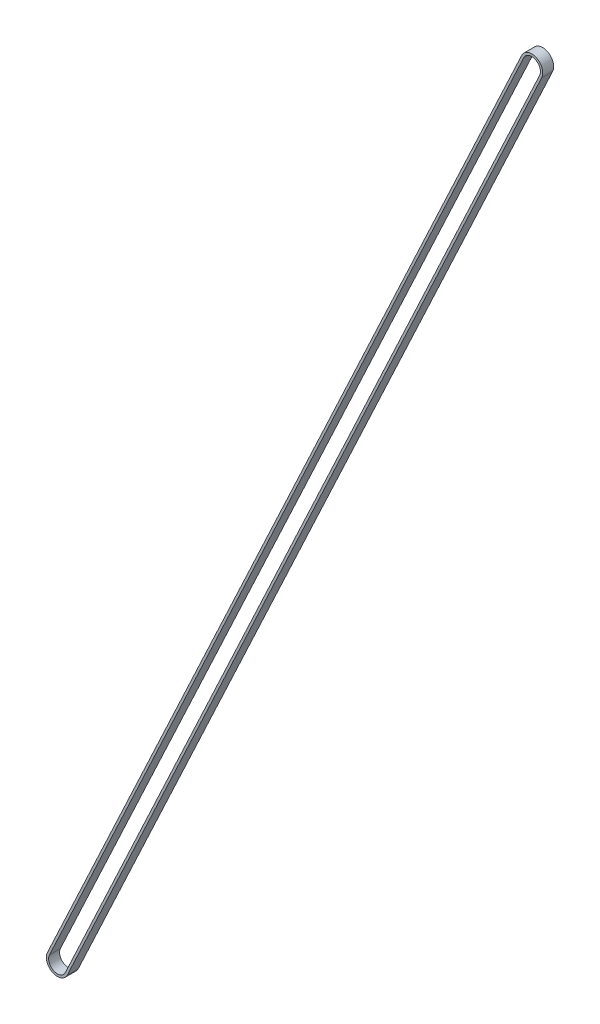
ISO-10303-21;
HEADER;
FILE_DESCRIPTION(('STEP AP214'),'2;1');
FILE_NAME('part.step','',(''),(''),'','','');
FILE_SCHEMA(('AUTOMOTIVE_DESIGN { 1 0 10303 214 1 1 1 1 }'));
ENDSEC;
DATA;
#1=APPLICATION_CONTEXT('core data for automotive mechanical design processes');
#2=APPLICATION_PROTOCOL_DEFINITION('international standard','automotive_design',2000,#1);
#3=PRODUCT_CONTEXT('',#1,'mechanical');
#4=PRODUCT('Part','Part','',(#3));
#5=PRODUCT_RELATED_PRODUCT_CATEGORY('part','',(#4));
#6=PRODUCT_DEFINITION_FORMATION('','',#4);
#7=PRODUCT_DEFINITION_CONTEXT('part definition',#1,'design');
#8=PRODUCT_DEFINITION('design','',#6,#7);
#9=PRODUCT_DEFINITION_SHAPE('','',#8);
#10=(LENGTH_UNIT() NAMED_UNIT(*) SI_UNIT(.MILLI.,.METRE.));
#11=(NAMED_UNIT(*) PLANE_ANGLE_UNIT() SI_UNIT($,.RADIAN.));
#12=(NAMED_UNIT(*) SI_UNIT($,.STERADIAN.) SOLID_ANGLE_UNIT());
#13=UNCERTAINTY_MEASURE_WITH_UNIT(LENGTH_MEASURE(1.E-05),#10,'distance_accuracy_value','');
#14=(GEOMETRIC_REPRESENTATION_CONTEXT(3) GLOBAL_UNCERTAINTY_ASSIGNED_CONTEXT((#13)) GLOBAL_UNIT_ASSIGNED_CONTEXT((#10,
#11,#12)) REPRESENTATION_CONTEXT('',''));
#15=CARTESIAN_POINT('',(0.,0.,0.));
#16=DIRECTION('',(0.,0.,1.));
#17=DIRECTION('',(1.,0.,0.));
#18=AXIS2_PLACEMENT_3D('',#15,#16,#17);
#19=CARTESIAN_POINT('',(-2.15892876727075,13.6484173672822,-7.26980860200179));
#20=DIRECTION('',(0.,0.,1.));
#21=DIRECTION('',(0.,-1.,0.));
#22=AXIS2_PLACEMENT_3D('',#19,#20,#21);
#23=PLANE('',#22);
#24=DIRECTION('',(0.423643456524163,0.905829024564934,0.));
#25=VECTOR('',#24,1.);
#26=CARTESIAN_POINT('',(16.4253102642104,8.0638701509914,-7.26980860200045));
#27=LINE('',#26,#25);
#28=CARTESIAN_POINT('',(-808.996594894675,-1756.84269854508,-7.26980860192287));
#29=VERTEX_POINT('',#28);
#30=CARTESIAN_POINT('',(15.232988504376,5.51446300201818,-7.26980860200033));
#31=VERTEX_POINT('',#30);
#32=EDGE_CURVE('E162',#29,#31,#27,.T.);
#33=ORIENTED_EDGE('',*,*,#32,.T.);
#34=CARTESIAN_POINT('',(-2.15892876727075,13.6484173672822,-7.26980860200179));
#35=DIRECTION('',(0.,0.,1.));
#36=DIRECTION('',(0.,-1.,0.));
#37=AXIS2_PLACEMENT_3D('',#34,#35,#36);
#38=CIRCLE('',#37,19.2);
#39=CARTESIAN_POINT('',(-19.5508460389174,21.7823717325461,-7.26980860200325));
#40=VERTEX_POINT('',#39);
#41=EDGE_CURVE('E165',#31,#40,#38,.T.);
#42=ORIENTED_EDGE('',*,*,#41,.T.);
#43=DIRECTION('',(-0.423643456524163,-0.905829024564934,0.));
#44=VECTOR('',#43,1.);
#45=CARTESIAN_POINT('',(-18.358524279083,24.3317788815192,-7.26980860200336));
#46=LINE('',#45,#44);
#47=CARTESIAN_POINT('',(-843.780429437968,-1740.57478981455,-7.26980860192579));
#48=VERTEX_POINT('',#47);
#49=EDGE_CURVE('E168',#40,#48,#46,.T.);
#50=ORIENTED_EDGE('',*,*,#49,.T.);
#51=CARTESIAN_POINT('',(-826.388512166321,-1748.70874417981,-7.26980860192433));
#52=DIRECTION('',(0.,0.,1.));
#53=DIRECTION('',(0.,-1.,0.));
#54=AXIS2_PLACEMENT_3D('',#51,#52,#53);
#55=CIRCLE('',#54,19.1999999999999);
#56=EDGE_CURVE('E170',#48,#29,#55,.T.);
#57=ORIENTED_EDGE('',*,*,#56,.T.);
#58=EDGE_LOOP('',(#33,#42,#50,#57));
#59=FACE_BOUND('',#58,.T.);
#60=CARTESIAN_POINT('',(-2.15892876727075,13.6484173672822,-7.26980860200179));
#61=DIRECTION('',(0.,0.,1.));
#62=DIRECTION('',(0.,-1.,0.));
#63=AXIS2_PLACEMENT_3D('',#60,#61,#62);
#64=CIRCLE('',#63,15.2);
#65=CARTESIAN_POINT('',(11.6096724061162,7.20903682811484,-7.26980860200064));
#66=VERTEX_POINT('',#65);
#67=CARTESIAN_POINT('',(-15.9275299406576,20.0877979064498,-7.26980860200295));
#68=VERTEX_POINT('',#67);
#69=EDGE_CURVE('E134',#66,#68,#64,.T.);
#70=ORIENTED_EDGE('',*,*,#69,.F.);
#71=DIRECTION('',(0.423643456524163,0.905829024564934,0.));
#72=VECTOR('',#71,1.);
#73=CARTESIAN_POINT('',(12.8019941659507,9.75844397708805,-7.26980860200075));
#74=LINE('',#73,#72);
#75=CARTESIAN_POINT('',(-812.619910992934,-1755.14812471898,-7.26980860192318));
#76=VERTEX_POINT('',#75);
#77=EDGE_CURVE('E126',#76,#66,#74,.T.);
#78=ORIENTED_EDGE('',*,*,#77,.F.);
#79=CARTESIAN_POINT('',(-826.388512166321,-1748.70874417981,-7.26980860192433));
#80=DIRECTION('',(0.,0.,1.));
#81=DIRECTION('',(0.,-1.,0.));
#82=AXIS2_PLACEMENT_3D('',#79,#80,#81);
#83=CIRCLE('',#82,15.1999999999999);
#84=CARTESIAN_POINT('',(-840.157113339708,-1742.26936364065,-7.26980860192548));
#85=VERTEX_POINT('',#84);
#86=EDGE_CURVE('E148',#85,#76,#83,.T.);
#87=ORIENTED_EDGE('',*,*,#86,.F.);
#88=DIRECTION('',(-0.423643456524163,-0.905829024564934,0.));
#89=VECTOR('',#88,1.);
#90=CARTESIAN_POINT('',(-14.7352081808233,22.6372050554226,-7.26980860200306));
#91=LINE('',#90,#89);
#92=EDGE_CURVE('E146',#68,#85,#91,.T.);
#93=ORIENTED_EDGE('',*,*,#92,.F.);
#94=EDGE_LOOP('',(#70,#78,#87,#93));
#95=FACE_BOUND('',#94,.T.);
#96=ADVANCED_FACE('F61',(#59,#95),#23,.T.);
#97=CARTESIAN_POINT('',(-2.15892876727075,13.6484173672822,-26.2698086020018));
#98=DIRECTION('',(0.,0.,1.));
#99=DIRECTION('',(0.,-1.,0.));
#100=AXIS2_PLACEMENT_3D('',#97,#98,#99);
#101=PLANE('',#100);
#102=DIRECTION('',(0.423643456524163,0.905829024564934,0.));
#103=VECTOR('',#102,1.);
#104=CARTESIAN_POINT('',(16.4253102642104,8.0638701509914,-26.2698086020004));
#105=LINE('',#104,#103);
#106=CARTESIAN_POINT('',(-808.996594894675,-1756.84269854508,-26.2698086019229));
#107=VERTEX_POINT('',#106);
#108=CARTESIAN_POINT('',(15.232988504376,5.51446300201818,-26.2698086020003));
#109=VERTEX_POINT('',#108);
#110=EDGE_CURVE('E142',#107,#109,#105,.T.);
#111=ORIENTED_EDGE('',*,*,#110,.F.);
#112=CARTESIAN_POINT('',(-826.388512166321,-1748.70874417981,-26.2698086019243));
#113=DIRECTION('',(0.,0.,1.));
#114=DIRECTION('',(0.,-1.,0.));
#115=AXIS2_PLACEMENT_3D('',#112,#113,#114);
#116=CIRCLE('',#115,19.1999999999999);
#117=CARTESIAN_POINT('',(-843.780429437968,-1740.57478981455,-26.2698086019258));
#118=VERTEX_POINT('',#117);
#119=EDGE_CURVE('E166',#118,#107,#116,.T.);
#120=ORIENTED_EDGE('',*,*,#119,.F.);
#121=DIRECTION('',(-0.423643456524163,-0.905829024564934,0.));
#122=VECTOR('',#121,1.);
#123=CARTESIAN_POINT('',(-18.358524279083,24.3317788815192,-26.2698086020034));
#124=LINE('',#123,#122);
#125=CARTESIAN_POINT('',(-19.5508460389174,21.7823717325461,-26.2698086020033));
#126=VERTEX_POINT('',#125);
#127=EDGE_CURVE('E177',#126,#118,#124,.T.);
#128=ORIENTED_EDGE('',*,*,#127,.F.);
#129=CARTESIAN_POINT('',(-2.15892876727075,13.6484173672822,-26.2698086020018));
#130=DIRECTION('',(0.,0.,1.));
#131=DIRECTION('',(0.,-1.,0.));
#132=AXIS2_PLACEMENT_3D('',#129,#130,#131);
#133=CIRCLE('',#132,19.2);
#134=EDGE_CURVE('E175',#109,#126,#133,.T.);
#135=ORIENTED_EDGE('',*,*,#134,.F.);
#136=EDGE_LOOP('',(#111,#120,#128,#135));
#137=FACE_BOUND('',#136,.T.);
#138=DIRECTION('',(0.423643456524163,0.905829024564934,0.));
#139=VECTOR('',#138,1.);
#140=CARTESIAN_POINT('',(12.8019941659507,9.75844397708805,-26.2698086020008));
#141=LINE('',#140,#139);
#142=CARTESIAN_POINT('',(-812.619910992934,-1755.14812471898,-26.2698086019232));
#143=VERTEX_POINT('',#142);
#144=CARTESIAN_POINT('',(11.6096724061162,7.20903682811484,-26.2698086020006));
#145=VERTEX_POINT('',#144);
#146=EDGE_CURVE('E84',#143,#145,#141,.T.);
#147=ORIENTED_EDGE('',*,*,#146,.T.);
#148=CARTESIAN_POINT('',(-2.15892876727075,13.6484173672822,-26.2698086020018));
#149=DIRECTION('',(0.,0.,1.));
#150=DIRECTION('',(0.,-1.,0.));
#151=AXIS2_PLACEMENT_3D('',#148,#149,#150);
#152=CIRCLE('',#151,15.2);
#153=CARTESIAN_POINT('',(-15.9275299406576,20.0877979064498,-26.2698086020029));
#154=VERTEX_POINT('',#153);
#155=EDGE_CURVE('E141',#145,#154,#152,.T.);
#156=ORIENTED_EDGE('',*,*,#155,.T.);
#157=DIRECTION('',(-0.423643456524163,-0.905829024564934,0.));
#158=VECTOR('',#157,1.);
#159=CARTESIAN_POINT('',(-14.7352081808233,22.6372050554226,-26.2698086020031));
#160=LINE('',#159,#158);
#161=CARTESIAN_POINT('',(-840.157113339708,-1742.26936364065,-26.2698086019255));
#162=VERTEX_POINT('',#161);
#163=EDGE_CURVE('E154',#154,#162,#160,.T.);
#164=ORIENTED_EDGE('',*,*,#163,.T.);
#165=CARTESIAN_POINT('',(-826.388512166321,-1748.70874417981,-26.2698086019243));
#166=DIRECTION('',(0.,0.,1.));
#167=DIRECTION('',(0.,-1.,0.));
#168=AXIS2_PLACEMENT_3D('',#165,#166,#167);
#169=CIRCLE('',#168,15.1999999999999);
#170=EDGE_CURVE('E135',#162,#143,#169,.T.);
#171=ORIENTED_EDGE('',*,*,#170,.T.);
#172=EDGE_LOOP('',(#147,#156,#164,#171));
#173=FACE_BOUND('',#172,.T.);
#174=ADVANCED_FACE('F195',(#137,#173),#101,.F.);
#175=CARTESIAN_POINT('',(16.4253102642104,8.0638701509914,-7.26980860200045));
#176=DIRECTION('',(-0.905829024564934,0.423643456524163,0.));
#177=DIRECTION('',(-0.423643456524163,-0.905829024564934,0.));
#178=AXIS2_PLACEMENT_3D('',#175,#176,#177);
#179=PLANE('',#178);
#180=ORIENTED_EDGE('',*,*,#110,.T.);
#181=DIRECTION('',(0.,0.,-1.));
#182=VECTOR('',#181,1.);
#183=CARTESIAN_POINT('',(15.232988504376,5.51446300201818,-7.26980860200033));
#184=LINE('',#183,#182);
#185=EDGE_CURVE('E12',#31,#109,#184,.T.);
#186=ORIENTED_EDGE('',*,*,#185,.F.);
#187=ORIENTED_EDGE('',*,*,#32,.F.);
#188=DIRECTION('',(0.,0.,-1.));
#189=VECTOR('',#188,1.);
#190=CARTESIAN_POINT('',(-808.996594894675,-1756.84269854508,-7.26980860192287));
#191=LINE('',#190,#189);
#192=EDGE_CURVE('E172',#29,#107,#191,.T.);
#193=ORIENTED_EDGE('',*,*,#192,.T.);
#194=EDGE_LOOP('',(#180,#186,#187,#193));
#195=FACE_BOUND('',#194,.T.);
#196=ADVANCED_FACE('F63',(#195),#179,.F.);
#197=CARTESIAN_POINT('',(-2.15892876727075,13.6484173672822,-7.26980860200179));
#198=DIRECTION('',(0.,0.,-1.));
#199=DIRECTION('',(-1.,0.,0.));
#200=AXIS2_PLACEMENT_3D('',#197,#198,#199);
#201=CYLINDRICAL_SURFACE('',#200,19.2);
#202=ORIENTED_EDGE('',*,*,#134,.T.);
#203=DIRECTION('',(0.,0.,-1.));
#204=VECTOR('',#203,1.);
#205=CARTESIAN_POINT('',(-19.5508460389174,21.7823717325461,-7.26980860200325));
#206=LINE('',#205,#204);
#207=EDGE_CURVE('E69',#40,#126,#206,.T.);
#208=ORIENTED_EDGE('',*,*,#207,.F.);
#209=ORIENTED_EDGE('',*,*,#41,.F.);
#210=ORIENTED_EDGE('',*,*,#185,.T.);
#211=EDGE_LOOP('',(#202,#208,#209,#210));
#212=FACE_BOUND('',#211,.T.);
#213=ADVANCED_FACE('F205',(#212),#201,.T.);
#214=CARTESIAN_POINT('',(-18.358524279083,24.3317788815192,-7.26980860200336));
#215=DIRECTION('',(0.905829024564934,-0.423643456524163,0.));
#216=DIRECTION('',(0.423643456524163,0.905829024564934,0.));
#217=AXIS2_PLACEMENT_3D('',#214,#215,#216);
#218=PLANE('',#217);
#219=ORIENTED_EDGE('',*,*,#127,.T.);
#220=DIRECTION('',(0.,0.,-1.));
#221=VECTOR('',#220,1.);
#222=CARTESIAN_POINT('',(-843.780429437968,-1740.57478981455,-7.26980860192579));
#223=LINE('',#222,#221);
#224=EDGE_CURVE('E182',#48,#118,#223,.T.);
#225=ORIENTED_EDGE('',*,*,#224,.F.);
#226=ORIENTED_EDGE('',*,*,#49,.F.);
#227=ORIENTED_EDGE('',*,*,#207,.T.);
#228=EDGE_LOOP('',(#219,#225,#226,#227));
#229=FACE_BOUND('',#228,.T.);
#230=ADVANCED_FACE('F189',(#229),#218,.F.);
#231=CARTESIAN_POINT('',(-826.388512166321,-1748.70874417981,-7.26980860192433));
#232=DIRECTION('',(0.,0.,-1.));
#233=DIRECTION('',(-1.,0.,0.));
#234=AXIS2_PLACEMENT_3D('',#231,#232,#233);
#235=CYLINDRICAL_SURFACE('',#234,19.1999999999999);
#236=ORIENTED_EDGE('',*,*,#119,.T.);
#237=ORIENTED_EDGE('',*,*,#192,.F.);
#238=ORIENTED_EDGE('',*,*,#56,.F.);
#239=ORIENTED_EDGE('',*,*,#224,.T.);
#240=EDGE_LOOP('',(#236,#237,#238,#239));
#241=FACE_BOUND('',#240,.T.);
#242=ADVANCED_FACE('F199',(#241),#235,.T.);
#243=CARTESIAN_POINT('',(12.8019941659507,9.75844397708805,-7.26980860200075));
#244=DIRECTION('',(-0.905829024564934,0.423643456524163,0.));
#245=DIRECTION('',(-0.423643456524163,-0.905829024564934,0.));
#246=AXIS2_PLACEMENT_3D('',#243,#244,#245);
#247=PLANE('',#246);
#248=ORIENTED_EDGE('',*,*,#146,.F.);
#249=DIRECTION('',(0.,0.,-1.));
#250=VECTOR('',#249,1.);
#251=CARTESIAN_POINT('',(-812.619910992934,-1755.14812471898,-7.26980860192318));
#252=LINE('',#251,#250);
#253=EDGE_CURVE('E130',#76,#143,#252,.T.);
#254=ORIENTED_EDGE('',*,*,#253,.F.);
#255=ORIENTED_EDGE('',*,*,#77,.T.);
#256=DIRECTION('',(0.,0.,-1.));
#257=VECTOR('',#256,1.);
#258=CARTESIAN_POINT('',(11.6096724061162,7.20903682811484,-7.26980860200064));
#259=LINE('',#258,#257);
#260=EDGE_CURVE('E129',#66,#145,#259,.T.);
#261=ORIENTED_EDGE('',*,*,#260,.T.);
#262=EDGE_LOOP('',(#248,#254,#255,#261));
#263=FACE_BOUND('',#262,.T.);
#264=ADVANCED_FACE('F128',(#263),#247,.T.);
#265=CARTESIAN_POINT('',(-2.15892876727075,13.6484173672822,-7.26980860200179));
#266=DIRECTION('',(0.,0.,-1.));
#267=DIRECTION('',(-1.,0.,0.));
#268=AXIS2_PLACEMENT_3D('',#265,#266,#267);
#269=CYLINDRICAL_SURFACE('',#268,15.2);
#270=ORIENTED_EDGE('',*,*,#155,.F.);
#271=ORIENTED_EDGE('',*,*,#260,.F.);
#272=ORIENTED_EDGE('',*,*,#69,.T.);
#273=DIRECTION('',(0.,0.,-1.));
#274=VECTOR('',#273,1.);
#275=CARTESIAN_POINT('',(-15.9275299406576,20.0877979064498,-7.26980860200295));
#276=LINE('',#275,#274);
#277=EDGE_CURVE('E143',#68,#154,#276,.T.);
#278=ORIENTED_EDGE('',*,*,#277,.T.);
#279=EDGE_LOOP('',(#270,#271,#272,#278));
#280=FACE_BOUND('',#279,.T.);
#281=ADVANCED_FACE('F138',(#280),#269,.F.);
#282=CARTESIAN_POINT('',(-14.7352081808233,22.6372050554226,-7.26980860200306));
#283=DIRECTION('',(0.905829024564934,-0.423643456524163,0.));
#284=DIRECTION('',(0.423643456524163,0.905829024564934,0.));
#285=AXIS2_PLACEMENT_3D('',#282,#283,#284);
#286=PLANE('',#285);
#287=ORIENTED_EDGE('',*,*,#163,.F.);
#288=ORIENTED_EDGE('',*,*,#277,.F.);
#289=ORIENTED_EDGE('',*,*,#92,.T.);
#290=DIRECTION('',(0.,0.,-1.));
#291=VECTOR('',#290,1.);
#292=CARTESIAN_POINT('',(-840.157113339708,-1742.26936364065,-7.26980860192548));
#293=LINE('',#292,#291);
#294=EDGE_CURVE('E76',#85,#162,#293,.T.);
#295=ORIENTED_EDGE('',*,*,#294,.T.);
#296=EDGE_LOOP('',(#287,#288,#289,#295));
#297=FACE_BOUND('',#296,.T.);
#298=ADVANCED_FACE('F228',(#297),#286,.T.);
#299=CARTESIAN_POINT('',(-826.388512166321,-1748.70874417981,-7.26980860192433));
#300=DIRECTION('',(0.,0.,-1.));
#301=DIRECTION('',(-1.,0.,0.));
#302=AXIS2_PLACEMENT_3D('',#299,#300,#301);
#303=CYLINDRICAL_SURFACE('',#302,15.1999999999999);
#304=ORIENTED_EDGE('',*,*,#170,.F.);
#305=ORIENTED_EDGE('',*,*,#294,.F.);
#306=ORIENTED_EDGE('',*,*,#86,.T.);
#307=ORIENTED_EDGE('',*,*,#253,.T.);
#308=EDGE_LOOP('',(#304,#305,#306,#307));
#309=FACE_BOUND('',#308,.T.);
#310=ADVANCED_FACE('F232',(#309),#303,.F.);
#311=CLOSED_SHELL('',(#96,#174,#196,#213,#230,#242,#264,#281,#298,#310));
#312=MANIFOLD_SOLID_BREP('B2',#311);
#313=ADVANCED_BREP_SHAPE_REPRESENTATION('',(#18,#312),#14);
#314=SHAPE_DEFINITION_REPRESENTATION(#9,#313);
ENDSEC;
END-ISO-10303-21;
